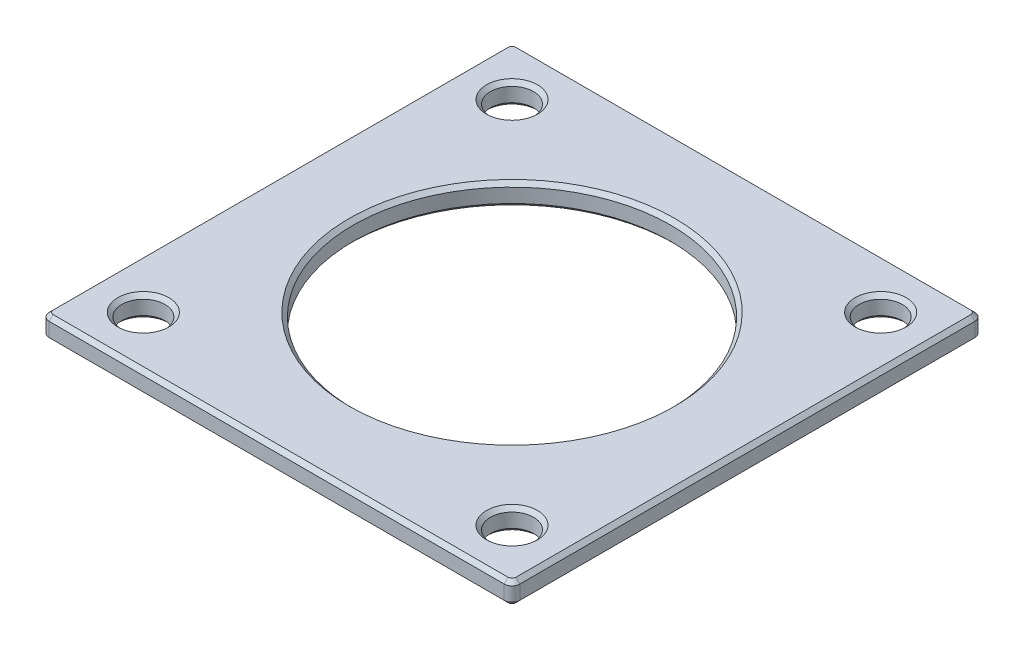
ISO-10303-21;
HEADER;
FILE_DESCRIPTION(('STEP AP214'),'2;1');
FILE_NAME('part.step','',(''),(''),'','','');
FILE_SCHEMA(('AUTOMOTIVE_DESIGN { 1 0 10303 214 1 1 1 1 }'));
ENDSEC;
DATA;
#1=APPLICATION_CONTEXT('core data for automotive mechanical design processes');
#2=APPLICATION_PROTOCOL_DEFINITION('international standard','automotive_design',2000,#1);
#3=PRODUCT_CONTEXT('',#1,'mechanical');
#4=PRODUCT('Part','Part','',(#3));
#5=PRODUCT_RELATED_PRODUCT_CATEGORY('part','',(#4));
#6=PRODUCT_DEFINITION_FORMATION('','',#4);
#7=PRODUCT_DEFINITION_CONTEXT('part definition',#1,'design');
#8=PRODUCT_DEFINITION('design','',#6,#7);
#9=PRODUCT_DEFINITION_SHAPE('','',#8);
#10=(LENGTH_UNIT() NAMED_UNIT(*) SI_UNIT(.MILLI.,.METRE.));
#11=(NAMED_UNIT(*) PLANE_ANGLE_UNIT() SI_UNIT($,.RADIAN.));
#12=(NAMED_UNIT(*) SI_UNIT($,.STERADIAN.) SOLID_ANGLE_UNIT());
#13=UNCERTAINTY_MEASURE_WITH_UNIT(LENGTH_MEASURE(1.E-05),#10,'distance_accuracy_value','');
#14=(GEOMETRIC_REPRESENTATION_CONTEXT(3) GLOBAL_UNCERTAINTY_ASSIGNED_CONTEXT((#13)) GLOBAL_UNIT_ASSIGNED_CONTEXT((#10,
#11,#12)) REPRESENTATION_CONTEXT('',''));
#15=CARTESIAN_POINT('',(0.,0.,0.));
#16=DIRECTION('',(0.,0.,1.));
#17=DIRECTION('',(1.,0.,0.));
#18=AXIS2_PLACEMENT_3D('',#15,#16,#17);
#19=CARTESIAN_POINT('',(-60.3975927313227,2.8,64.4871255064724));
#20=DIRECTION('',(0.,-1.,0.));
#21=DIRECTION('',(0.,0.,-1.));
#22=AXIS2_PLACEMENT_3D('',#19,#20,#21);
#23=PLANE('',#22);
#24=CARTESIAN_POINT('',(-54.8975927313226,2.8,58.9871255064727));
#25=DIRECTION('',(0.,-1.,0.));
#26=DIRECTION('',(0.,0.,-1.));
#27=AXIS2_PLACEMENT_3D('',#24,#25,#26);
#28=CIRCLE('',#27,3.24999999999999);
#29=CARTESIAN_POINT('',(-54.8975927313226,2.8,55.7371255064727));
#30=VERTEX_POINT('',#29);
#31=EDGE_CURVE('E11',#30,#30,#28,.T.);
#32=ORIENTED_EDGE('',*,*,#31,.T.);
#33=EDGE_LOOP('',(#32));
#34=FACE_BOUND('',#33,.T.);
#35=CARTESIAN_POINT('',(-7.89759273132259,2.8,58.9871255064725));
#36=DIRECTION('',(0.,-1.,0.));
#37=DIRECTION('',(0.,0.,-1.));
#38=AXIS2_PLACEMENT_3D('',#35,#36,#37);
#39=CIRCLE('',#38,3.24999999999999);
#40=CARTESIAN_POINT('',(-7.89759273132259,2.8,55.7371255064725));
#41=VERTEX_POINT('',#40);
#42=EDGE_CURVE('E51',#41,#41,#39,.T.);
#43=ORIENTED_EDGE('',*,*,#42,.T.);
#44=EDGE_LOOP('',(#43));
#45=FACE_BOUND('',#44,.T.);
#46=CARTESIAN_POINT('',(-7.89759273132278,2.8,11.9871255064722));
#47=DIRECTION('',(0.,-1.,0.));
#48=DIRECTION('',(0.,0.,-1.));
#49=AXIS2_PLACEMENT_3D('',#46,#47,#48);
#50=CIRCLE('',#49,3.24999999999999);
#51=CARTESIAN_POINT('',(-7.89759273132278,2.8,8.7371255064722));
#52=VERTEX_POINT('',#51);
#53=EDGE_CURVE('E281',#52,#52,#50,.T.);
#54=ORIENTED_EDGE('',*,*,#53,.T.);
#55=EDGE_LOOP('',(#54));
#56=FACE_BOUND('',#55,.T.);
#57=CARTESIAN_POINT('',(-54.8975927313228,2.8,11.9871255064724));
#58=DIRECTION('',(0.,-1.,0.));
#59=DIRECTION('',(0.,0.,-1.));
#60=AXIS2_PLACEMENT_3D('',#57,#58,#59);
#61=CIRCLE('',#60,3.24999999999999);
#62=CARTESIAN_POINT('',(-54.8975927313228,2.8,8.73712550647237));
#63=VERTEX_POINT('',#62);
#64=EDGE_CURVE('E278',#63,#63,#61,.T.);
#65=ORIENTED_EDGE('',*,*,#64,.T.);
#66=EDGE_LOOP('',(#65));
#67=FACE_BOUND('',#66,.T.);
#68=CARTESIAN_POINT('',(-31.3975927313227,2.8,35.4871255064724));
#69=DIRECTION('',(0.,-1.,0.));
#70=DIRECTION('',(0.,0.,-1.));
#71=AXIS2_PLACEMENT_3D('',#68,#69,#70);
#72=CIRCLE('',#71,20.75);
#73=CARTESIAN_POINT('',(-31.3975927313227,2.8,14.7371255064724));
#74=VERTEX_POINT('',#73);
#75=EDGE_CURVE('E275',#74,#74,#72,.T.);
#76=ORIENTED_EDGE('',*,*,#75,.T.);
#77=EDGE_LOOP('',(#76));
#78=FACE_BOUND('',#77,.T.);
#79=CARTESIAN_POINT('',(-60.3975927313227,2.8,6.48712550647243));
#80=DIRECTION('',(0.,-1.,0.));
#81=DIRECTION('',(0.,0.,-1.));
#82=AXIS2_PLACEMENT_3D('',#79,#80,#81);
#83=CIRCLE('',#82,0.499999999999994);
#84=CARTESIAN_POINT('',(-60.3975927313227,2.8,5.98712550647244));
#85=VERTEX_POINT('',#84);
#86=CARTESIAN_POINT('',(-60.8975927313227,2.8,6.48712550647244));
#87=VERTEX_POINT('',#86);
#88=EDGE_CURVE('E59',#85,#87,#83,.F.);
#89=ORIENTED_EDGE('',*,*,#88,.T.);
#90=DIRECTION('',(0.,0.,1.));
#91=VECTOR('',#90,1.);
#92=CARTESIAN_POINT('',(-60.8975927313227,2.8,64.4871255064724));
#93=LINE('',#92,#91);
#94=CARTESIAN_POINT('',(-60.8975927313227,2.8,64.4871255064724));
#95=VERTEX_POINT('',#94);
#96=EDGE_CURVE('E273',#87,#95,#93,.T.);
#97=ORIENTED_EDGE('',*,*,#96,.T.);
#98=CARTESIAN_POINT('',(-60.3975927313227,2.8,64.4871255064724));
#99=DIRECTION('',(0.,-1.,0.));
#100=DIRECTION('',(0.,0.,-1.));
#101=AXIS2_PLACEMENT_3D('',#98,#99,#100);
#102=CIRCLE('',#101,0.5);
#103=CARTESIAN_POINT('',(-60.3975927313227,2.8,64.9871255064724));
#104=VERTEX_POINT('',#103);
#105=EDGE_CURVE('E261',#95,#104,#102,.F.);
#106=ORIENTED_EDGE('',*,*,#105,.T.);
#107=DIRECTION('',(1.,0.,0.));
#108=VECTOR('',#107,1.);
#109=CARTESIAN_POINT('',(-60.3975927313227,2.8,64.9871255064724));
#110=LINE('',#109,#108);
#111=CARTESIAN_POINT('',(-2.3975927313227,2.8,64.9871255064724));
#112=VERTEX_POINT('',#111);
#113=EDGE_CURVE('E263',#104,#112,#110,.T.);
#114=ORIENTED_EDGE('',*,*,#113,.T.);
#115=CARTESIAN_POINT('',(-2.39759273132269,2.8,64.4871255064724));
#116=DIRECTION('',(0.,-1.,0.));
#117=DIRECTION('',(0.,0.,-1.));
#118=AXIS2_PLACEMENT_3D('',#115,#116,#117);
#119=CIRCLE('',#118,0.499999999999987);
#120=CARTESIAN_POINT('',(-1.89759273132271,2.8,64.4871255064724));
#121=VERTEX_POINT('',#120);
#122=EDGE_CURVE('E265',#112,#121,#119,.F.);
#123=ORIENTED_EDGE('',*,*,#122,.T.);
#124=DIRECTION('',(0.,0.,-1.));
#125=VECTOR('',#124,1.);
#126=CARTESIAN_POINT('',(-1.8975927313227,2.8,64.4871255064724));
#127=LINE('',#126,#125);
#128=CARTESIAN_POINT('',(-1.8975927313227,2.8,6.48712550647244));
#129=VERTEX_POINT('',#128);
#130=EDGE_CURVE('E267',#121,#129,#127,.T.);
#131=ORIENTED_EDGE('',*,*,#130,.T.);
#132=CARTESIAN_POINT('',(-2.39759273132269,2.8,6.48712550647243));
#133=DIRECTION('',(0.,-1.,0.));
#134=DIRECTION('',(0.,0.,-1.));
#135=AXIS2_PLACEMENT_3D('',#132,#133,#134);
#136=CIRCLE('',#135,0.499999999999992);
#137=CARTESIAN_POINT('',(-2.3975927313227,2.8,5.98712550647244));
#138=VERTEX_POINT('',#137);
#139=EDGE_CURVE('E269',#129,#138,#136,.F.);
#140=ORIENTED_EDGE('',*,*,#139,.T.);
#141=DIRECTION('',(-1.,0.,0.));
#142=VECTOR('',#141,1.);
#143=CARTESIAN_POINT('',(-60.3975927313227,2.8,5.98712550647244));
#144=LINE('',#143,#142);
#145=EDGE_CURVE('E64',#138,#85,#144,.T.);
#146=ORIENTED_EDGE('',*,*,#145,.T.);
#147=EDGE_LOOP('',(#89,#97,#106,#114,#123,#131,#140,#146));
#148=FACE_BOUND('',#147,.T.);
#149=ADVANCED_FACE('F41',(#34,#45,#56,#67,#78,#148),#23,.F.);
#150=CARTESIAN_POINT('',(-60.3975927313227,0.,64.4871255064724));
#151=DIRECTION('',(0.,-1.,0.));
#152=DIRECTION('',(0.,0.,-1.));
#153=AXIS2_PLACEMENT_3D('',#150,#151,#152);
#154=PLANE('',#153);
#155=CARTESIAN_POINT('',(-54.8975927313226,0.,58.9871255064727));
#156=DIRECTION('',(0.,-1.,0.));
#157=DIRECTION('',(0.,0.,-1.));
#158=AXIS2_PLACEMENT_3D('',#155,#156,#157);
#159=CIRCLE('',#158,3.25000000000002);
#160=CARTESIAN_POINT('',(-54.8975927313226,0.,55.7371255064727));
#161=VERTEX_POINT('',#160);
#162=EDGE_CURVE('E196',#161,#161,#159,.F.);
#163=ORIENTED_EDGE('',*,*,#162,.T.);
#164=EDGE_LOOP('',(#163));
#165=FACE_BOUND('',#164,.T.);
#166=CARTESIAN_POINT('',(-7.89759273132278,0.,11.9871255064722));
#167=DIRECTION('',(0.,-1.,0.));
#168=DIRECTION('',(0.,0.,-1.));
#169=AXIS2_PLACEMENT_3D('',#166,#167,#168);
#170=CIRCLE('',#169,3.24999999999999);
#171=CARTESIAN_POINT('',(-7.89759273132278,0.,8.7371255064722));
#172=VERTEX_POINT('',#171);
#173=EDGE_CURVE('E188',#172,#172,#170,.F.);
#174=ORIENTED_EDGE('',*,*,#173,.T.);
#175=EDGE_LOOP('',(#174));
#176=FACE_BOUND('',#175,.T.);
#177=CARTESIAN_POINT('',(-31.3975927313227,0.,35.4871255064724));
#178=DIRECTION('',(0.,-1.,0.));
#179=DIRECTION('',(0.,0.,-1.));
#180=AXIS2_PLACEMENT_3D('',#177,#178,#179);
#181=CIRCLE('',#180,20.75);
#182=CARTESIAN_POINT('',(-31.3975927313227,0.,14.7371255064724));
#183=VERTEX_POINT('',#182);
#184=EDGE_CURVE('E185',#183,#183,#181,.F.);
#185=ORIENTED_EDGE('',*,*,#184,.T.);
#186=EDGE_LOOP('',(#185));
#187=FACE_BOUND('',#186,.T.);
#188=CARTESIAN_POINT('',(-2.39759273132269,0.,64.4871255064724));
#189=DIRECTION('',(0.,-1.,0.));
#190=DIRECTION('',(0.,0.,-1.));
#191=AXIS2_PLACEMENT_3D('',#188,#189,#190);
#192=CIRCLE('',#191,0.5);
#193=CARTESIAN_POINT('',(-1.89759273132269,0.,64.4871255064724));
#194=VERTEX_POINT('',#193);
#195=CARTESIAN_POINT('',(-2.3975927313227,0.,64.9871255064724));
#196=VERTEX_POINT('',#195);
#197=EDGE_CURVE('E184',#194,#196,#192,.T.);
#198=ORIENTED_EDGE('',*,*,#197,.T.);
#199=DIRECTION('',(-1.,0.,0.));
#200=VECTOR('',#199,1.);
#201=CARTESIAN_POINT('',(-60.3975927313227,0.,64.9871255064724));
#202=LINE('',#201,#200);
#203=CARTESIAN_POINT('',(-60.3975927313227,0.,64.9871255064724));
#204=VERTEX_POINT('',#203);
#205=EDGE_CURVE('E162',#196,#204,#202,.T.);
#206=ORIENTED_EDGE('',*,*,#205,.T.);
#207=CARTESIAN_POINT('',(-60.3975927313227,0.,64.4871255064724));
#208=DIRECTION('',(0.,-1.,0.));
#209=DIRECTION('',(0.,0.,-1.));
#210=AXIS2_PLACEMENT_3D('',#207,#208,#209);
#211=CIRCLE('',#210,0.5);
#212=CARTESIAN_POINT('',(-60.8975927313227,0.,64.4871255064724));
#213=VERTEX_POINT('',#212);
#214=EDGE_CURVE('E172',#204,#213,#211,.T.);
#215=ORIENTED_EDGE('',*,*,#214,.T.);
#216=DIRECTION('',(0.,0.,-1.));
#217=VECTOR('',#216,1.);
#218=CARTESIAN_POINT('',(-60.8975927313227,0.,6.48712550647244));
#219=LINE('',#218,#217);
#220=CARTESIAN_POINT('',(-60.8975927313227,0.,6.48712550647244));
#221=VERTEX_POINT('',#220);
#222=EDGE_CURVE('E178',#213,#221,#219,.T.);
#223=ORIENTED_EDGE('',*,*,#222,.T.);
#224=CARTESIAN_POINT('',(-60.3975927313227,0.,6.48712550647243));
#225=DIRECTION('',(0.,-1.,0.));
#226=DIRECTION('',(0.,0.,-1.));
#227=AXIS2_PLACEMENT_3D('',#224,#225,#226);
#228=CIRCLE('',#227,0.5);
#229=CARTESIAN_POINT('',(-60.3975927313227,0.,5.98712550647243));
#230=VERTEX_POINT('',#229);
#231=EDGE_CURVE('E364',#221,#230,#228,.T.);
#232=ORIENTED_EDGE('',*,*,#231,.T.);
#233=DIRECTION('',(1.,0.,0.));
#234=VECTOR('',#233,1.);
#235=CARTESIAN_POINT('',(-2.3975927313227,0.,5.98712550647243));
#236=LINE('',#235,#234);
#237=CARTESIAN_POINT('',(-2.3975927313227,0.,5.98712550647243));
#238=VERTEX_POINT('',#237);
#239=EDGE_CURVE('E366',#230,#238,#236,.T.);
#240=ORIENTED_EDGE('',*,*,#239,.T.);
#241=CARTESIAN_POINT('',(-2.39759273132269,0.,6.48712550647243));
#242=DIRECTION('',(0.,-1.,0.));
#243=DIRECTION('',(0.,0.,-1.));
#244=AXIS2_PLACEMENT_3D('',#241,#242,#243);
#245=CIRCLE('',#244,0.500000000000001);
#246=CARTESIAN_POINT('',(-1.89759273132269,0.,6.48712550647244));
#247=VERTEX_POINT('',#246);
#248=EDGE_CURVE('E368',#238,#247,#245,.T.);
#249=ORIENTED_EDGE('',*,*,#248,.T.);
#250=DIRECTION('',(0.,0.,1.));
#251=VECTOR('',#250,1.);
#252=CARTESIAN_POINT('',(-1.89759273132269,0.,64.4871255064724));
#253=LINE('',#252,#251);
#254=EDGE_CURVE('E190',#247,#194,#253,.T.);
#255=ORIENTED_EDGE('',*,*,#254,.T.);
#256=EDGE_LOOP('',(#198,#206,#215,#223,#232,#240,#249,#255));
#257=FACE_BOUND('',#256,.T.);
#258=CARTESIAN_POINT('',(-54.8975927313228,0.,11.9871255064724));
#259=DIRECTION('',(0.,-1.,0.));
#260=DIRECTION('',(0.,0.,-1.));
#261=AXIS2_PLACEMENT_3D('',#258,#259,#260);
#262=CIRCLE('',#261,3.24999999999999);
#263=CARTESIAN_POINT('',(-54.8975927313228,0.,8.73712550647237));
#264=VERTEX_POINT('',#263);
#265=EDGE_CURVE('E179',#264,#264,#262,.F.);
#266=ORIENTED_EDGE('',*,*,#265,.T.);
#267=EDGE_LOOP('',(#266));
#268=FACE_BOUND('',#267,.T.);
#269=CARTESIAN_POINT('',(-7.89759273132259,0.,58.9871255064725));
#270=DIRECTION('',(0.,-1.,0.));
#271=DIRECTION('',(0.,0.,-1.));
#272=AXIS2_PLACEMENT_3D('',#269,#270,#271);
#273=CIRCLE('',#272,3.25);
#274=CARTESIAN_POINT('',(-7.89759273132259,0.,55.7371255064725));
#275=VERTEX_POINT('',#274);
#276=EDGE_CURVE('E358',#275,#275,#273,.F.);
#277=ORIENTED_EDGE('',*,*,#276,.T.);
#278=EDGE_LOOP('',(#277));
#279=FACE_BOUND('',#278,.T.);
#280=ADVANCED_FACE('F181',(#165,#176,#187,#257,#268,#279),#154,.T.);
#281=CARTESIAN_POINT('',(-60.3975927313227,2.8,64.4871255064724));
#282=DIRECTION('',(0.,-1.,0.));
#283=DIRECTION('',(0.,0.,-1.));
#284=AXIS2_PLACEMENT_3D('',#281,#282,#283);
#285=CYLINDRICAL_SURFACE('',#284,1.);
#286=DIRECTION('',(0.,-1.,0.));
#287=VECTOR('',#286,1.);
#288=CARTESIAN_POINT('',(-61.3975927313227,2.8,64.4871255064724));
#289=LINE('',#288,#287);
#290=CARTESIAN_POINT('',(-61.3975927313227,2.3,64.4871255064724));
#291=VERTEX_POINT('',#290);
#292=CARTESIAN_POINT('',(-61.3975927313227,0.49999999999999,64.4871255064724));
#293=VERTEX_POINT('',#292);
#294=EDGE_CURVE('E302',#291,#293,#289,.T.);
#295=ORIENTED_EDGE('',*,*,#294,.T.);
#296=CARTESIAN_POINT('',(-60.3975927313227,0.49999999999999,64.4871255064724));
#297=DIRECTION('',(0.,-1.,0.));
#298=DIRECTION('',(0.,0.,-1.));
#299=AXIS2_PLACEMENT_3D('',#296,#297,#298);
#300=CIRCLE('',#299,1.);
#301=CARTESIAN_POINT('',(-60.3975927313227,0.49999999999999,65.4871255064724));
#302=VERTEX_POINT('',#301);
#303=EDGE_CURVE('E247',#293,#302,#300,.F.);
#304=ORIENTED_EDGE('',*,*,#303,.T.);
#305=DIRECTION('',(0.,-1.,0.));
#306=VECTOR('',#305,1.);
#307=CARTESIAN_POINT('',(-60.3975927313227,2.8,65.4871255064724));
#308=LINE('',#307,#306);
#309=CARTESIAN_POINT('',(-60.3975927313227,2.3,65.4871255064724));
#310=VERTEX_POINT('',#309);
#311=EDGE_CURVE('E350',#310,#302,#308,.T.);
#312=ORIENTED_EDGE('',*,*,#311,.F.);
#313=CARTESIAN_POINT('',(-60.3975927313227,2.3,64.4871255064724));
#314=DIRECTION('',(0.,-1.,0.));
#315=DIRECTION('',(0.,0.,-1.));
#316=AXIS2_PLACEMENT_3D('',#313,#314,#315);
#317=CIRCLE('',#316,1.);
#318=EDGE_CURVE('E245',#310,#291,#317,.T.);
#319=ORIENTED_EDGE('',*,*,#318,.T.);
#320=EDGE_LOOP('',(#295,#304,#312,#319));
#321=FACE_BOUND('',#320,.T.);
#322=ADVANCED_FACE('F385',(#321),#285,.T.);
#323=CARTESIAN_POINT('',(-2.3975927313227,2.8,65.4871255064724));
#324=DIRECTION('',(0.,0.,-1.));
#325=DIRECTION('',(-1.,0.,0.));
#326=AXIS2_PLACEMENT_3D('',#323,#324,#325);
#327=PLANE('',#326);
#328=ORIENTED_EDGE('',*,*,#311,.T.);
#329=DIRECTION('',(1.,0.,0.));
#330=VECTOR('',#329,1.);
#331=CARTESIAN_POINT('',(-2.3975927313227,0.49999999999999,65.4871255064724));
#332=LINE('',#331,#330);
#333=CARTESIAN_POINT('',(-2.3975927313227,0.49999999999999,65.4871255064724));
#334=VERTEX_POINT('',#333);
#335=EDGE_CURVE('E165',#302,#334,#332,.T.);
#336=ORIENTED_EDGE('',*,*,#335,.T.);
#337=DIRECTION('',(0.,-1.,0.));
#338=VECTOR('',#337,1.);
#339=CARTESIAN_POINT('',(-2.3975927313227,2.8,65.4871255064724));
#340=LINE('',#339,#338);
#341=CARTESIAN_POINT('',(-2.3975927313227,2.3,65.4871255064724));
#342=VERTEX_POINT('',#341);
#343=EDGE_CURVE('E348',#342,#334,#340,.T.);
#344=ORIENTED_EDGE('',*,*,#343,.F.);
#345=DIRECTION('',(-1.,0.,0.));
#346=VECTOR('',#345,1.);
#347=CARTESIAN_POINT('',(-2.3975927313227,2.3,65.4871255064724));
#348=LINE('',#347,#346);
#349=EDGE_CURVE('E217',#342,#310,#348,.T.);
#350=ORIENTED_EDGE('',*,*,#349,.T.);
#351=EDGE_LOOP('',(#328,#336,#344,#350));
#352=FACE_BOUND('',#351,.T.);
#353=ADVANCED_FACE('F378',(#352),#327,.F.);
#354=CARTESIAN_POINT('',(-2.39759273132269,2.8,64.4871255064724));
#355=DIRECTION('',(0.,-1.,0.));
#356=DIRECTION('',(0.,0.,-1.));
#357=AXIS2_PLACEMENT_3D('',#354,#355,#356);
#358=CYLINDRICAL_SURFACE('',#357,1.);
#359=ORIENTED_EDGE('',*,*,#343,.T.);
#360=CARTESIAN_POINT('',(-2.39759273132269,0.49999999999999,64.4871255064724));
#361=DIRECTION('',(0.,-1.,0.));
#362=DIRECTION('',(0.,0.,-1.));
#363=AXIS2_PLACEMENT_3D('',#360,#361,#362);
#364=CIRCLE('',#363,1.);
#365=CARTESIAN_POINT('',(-1.39759273132269,0.49999999999999,64.4871255064724));
#366=VERTEX_POINT('',#365);
#367=EDGE_CURVE('E222',#334,#366,#364,.F.);
#368=ORIENTED_EDGE('',*,*,#367,.T.);
#369=DIRECTION('',(0.,-1.,0.));
#370=VECTOR('',#369,1.);
#371=CARTESIAN_POINT('',(-1.39759273132269,2.8,64.4871255064724));
#372=LINE('',#371,#370);
#373=CARTESIAN_POINT('',(-1.39759273132269,2.3,64.4871255064724));
#374=VERTEX_POINT('',#373);
#375=EDGE_CURVE('E339',#374,#366,#372,.T.);
#376=ORIENTED_EDGE('',*,*,#375,.F.);
#377=CARTESIAN_POINT('',(-2.39759273132269,2.3,64.4871255064724));
#378=DIRECTION('',(0.,-1.,0.));
#379=DIRECTION('',(0.,0.,-1.));
#380=AXIS2_PLACEMENT_3D('',#377,#378,#379);
#381=CIRCLE('',#380,1.);
#382=EDGE_CURVE('E220',#374,#342,#381,.T.);
#383=ORIENTED_EDGE('',*,*,#382,.T.);
#384=EDGE_LOOP('',(#359,#368,#376,#383));
#385=FACE_BOUND('',#384,.T.);
#386=ADVANCED_FACE('F345',(#385),#358,.T.);
#387=CARTESIAN_POINT('',(-1.39759273132269,2.8,64.4871255064724));
#388=DIRECTION('',(-1.,0.,0.));
#389=DIRECTION('',(0.,0.,1.));
#390=AXIS2_PLACEMENT_3D('',#387,#388,#389);
#391=PLANE('',#390);
#392=ORIENTED_EDGE('',*,*,#375,.T.);
#393=DIRECTION('',(0.,0.,-1.));
#394=VECTOR('',#393,1.);
#395=CARTESIAN_POINT('',(-1.39759273132269,0.49999999999999,6.48712550647244));
#396=LINE('',#395,#394);
#397=CARTESIAN_POINT('',(-1.39759273132269,0.49999999999999,6.48712550647244));
#398=VERTEX_POINT('',#397);
#399=EDGE_CURVE('E226',#366,#398,#396,.T.);
#400=ORIENTED_EDGE('',*,*,#399,.T.);
#401=DIRECTION('',(0.,-1.,0.));
#402=VECTOR('',#401,1.);
#403=CARTESIAN_POINT('',(-1.39759273132269,2.8,6.48712550647244));
#404=LINE('',#403,#402);
#405=CARTESIAN_POINT('',(-1.39759273132269,2.3,6.48712550647244));
#406=VERTEX_POINT('',#405);
#407=EDGE_CURVE('E342',#406,#398,#404,.T.);
#408=ORIENTED_EDGE('',*,*,#407,.F.);
#409=DIRECTION('',(0.,0.,1.));
#410=VECTOR('',#409,1.);
#411=CARTESIAN_POINT('',(-1.39759273132269,2.3,64.4871255064724));
#412=LINE('',#411,#410);
#413=EDGE_CURVE('E224',#406,#374,#412,.T.);
#414=ORIENTED_EDGE('',*,*,#413,.T.);
#415=EDGE_LOOP('',(#392,#400,#408,#414));
#416=FACE_BOUND('',#415,.T.);
#417=ADVANCED_FACE('F338',(#416),#391,.F.);
#418=CARTESIAN_POINT('',(-2.39759273132269,2.8,6.48712550647243));
#419=DIRECTION('',(0.,-1.,0.));
#420=DIRECTION('',(0.,0.,-1.));
#421=AXIS2_PLACEMENT_3D('',#418,#419,#420);
#422=CYLINDRICAL_SURFACE('',#421,1.);
#423=ORIENTED_EDGE('',*,*,#407,.T.);
#424=CARTESIAN_POINT('',(-2.39759273132269,0.49999999999999,6.48712550647243));
#425=DIRECTION('',(0.,-1.,0.));
#426=DIRECTION('',(0.,0.,-1.));
#427=AXIS2_PLACEMENT_3D('',#424,#425,#426);
#428=CIRCLE('',#427,1.);
#429=CARTESIAN_POINT('',(-2.3975927313227,0.49999999999999,5.48712550647243));
#430=VERTEX_POINT('',#429);
#431=EDGE_CURVE('E230',#398,#430,#428,.F.);
#432=ORIENTED_EDGE('',*,*,#431,.T.);
#433=DIRECTION('',(0.,-1.,0.));
#434=VECTOR('',#433,1.);
#435=CARTESIAN_POINT('',(-2.3975927313227,2.8,5.48712550647243));
#436=LINE('',#435,#434);
#437=CARTESIAN_POINT('',(-2.3975927313227,2.3,5.48712550647243));
#438=VERTEX_POINT('',#437);
#439=EDGE_CURVE('E352',#438,#430,#436,.T.);
#440=ORIENTED_EDGE('',*,*,#439,.F.);
#441=CARTESIAN_POINT('',(-2.39759273132269,2.3,6.48712550647243));
#442=DIRECTION('',(0.,-1.,0.));
#443=DIRECTION('',(0.,0.,-1.));
#444=AXIS2_PLACEMENT_3D('',#441,#442,#443);
#445=CIRCLE('',#444,1.);
#446=EDGE_CURVE('E228',#438,#406,#445,.T.);
#447=ORIENTED_EDGE('',*,*,#446,.T.);
#448=EDGE_LOOP('',(#423,#432,#440,#447));
#449=FACE_BOUND('',#448,.T.);
#450=ADVANCED_FACE('F430',(#449),#422,.T.);
#451=CARTESIAN_POINT('',(-2.3975927313227,2.8,5.48712550647243));
#452=DIRECTION('',(0.,0.,1.));
#453=DIRECTION('',(1.,0.,0.));
#454=AXIS2_PLACEMENT_3D('',#451,#452,#453);
#455=PLANE('',#454);
#456=ORIENTED_EDGE('',*,*,#439,.T.);
#457=DIRECTION('',(-1.,0.,0.));
#458=VECTOR('',#457,1.);
#459=CARTESIAN_POINT('',(-60.3975927313227,0.49999999999999,5.48712550647243));
#460=LINE('',#459,#458);
#461=CARTESIAN_POINT('',(-60.3975927313227,0.49999999999999,5.48712550647243));
#462=VERTEX_POINT('',#461);
#463=EDGE_CURVE('E234',#430,#462,#460,.T.);
#464=ORIENTED_EDGE('',*,*,#463,.T.);
#465=DIRECTION('',(0.,-1.,0.));
#466=VECTOR('',#465,1.);
#467=CARTESIAN_POINT('',(-60.3975927313227,2.8,5.48712550647243));
#468=LINE('',#467,#466);
#469=CARTESIAN_POINT('',(-60.3975927313227,2.3,5.48712550647243));
#470=VERTEX_POINT('',#469);
#471=EDGE_CURVE('E411',#470,#462,#468,.T.);
#472=ORIENTED_EDGE('',*,*,#471,.F.);
#473=DIRECTION('',(1.,0.,0.));
#474=VECTOR('',#473,1.);
#475=CARTESIAN_POINT('',(-2.3975927313227,2.3,5.48712550647243));
#476=LINE('',#475,#474);
#477=EDGE_CURVE('E232',#470,#438,#476,.T.);
#478=ORIENTED_EDGE('',*,*,#477,.T.);
#479=EDGE_LOOP('',(#456,#464,#472,#478));
#480=FACE_BOUND('',#479,.T.);
#481=ADVANCED_FACE('F419',(#480),#455,.F.);
#482=CARTESIAN_POINT('',(-60.3975927313227,2.8,6.48712550647243));
#483=DIRECTION('',(0.,-1.,0.));
#484=DIRECTION('',(0.,0.,-1.));
#485=AXIS2_PLACEMENT_3D('',#482,#483,#484);
#486=CYLINDRICAL_SURFACE('',#485,1.);
#487=ORIENTED_EDGE('',*,*,#471,.T.);
#488=CARTESIAN_POINT('',(-60.3975927313227,0.49999999999999,6.48712550647243));
#489=DIRECTION('',(0.,-1.,0.));
#490=DIRECTION('',(0.,0.,-1.));
#491=AXIS2_PLACEMENT_3D('',#488,#489,#490);
#492=CIRCLE('',#491,1.);
#493=CARTESIAN_POINT('',(-61.3975927313227,0.49999999999999,6.48712550647244));
#494=VERTEX_POINT('',#493);
#495=EDGE_CURVE('E238',#462,#494,#492,.F.);
#496=ORIENTED_EDGE('',*,*,#495,.T.);
#497=DIRECTION('',(0.,-1.,0.));
#498=VECTOR('',#497,1.);
#499=CARTESIAN_POINT('',(-61.3975927313227,2.8,6.48712550647244));
#500=LINE('',#499,#498);
#501=CARTESIAN_POINT('',(-61.3975927313227,2.3,6.48712550647244));
#502=VERTEX_POINT('',#501);
#503=EDGE_CURVE('E404',#502,#494,#500,.T.);
#504=ORIENTED_EDGE('',*,*,#503,.F.);
#505=CARTESIAN_POINT('',(-60.3975927313227,2.3,6.48712550647243));
#506=DIRECTION('',(0.,-1.,0.));
#507=DIRECTION('',(0.,0.,-1.));
#508=AXIS2_PLACEMENT_3D('',#505,#506,#507);
#509=CIRCLE('',#508,1.);
#510=EDGE_CURVE('E236',#502,#470,#509,.T.);
#511=ORIENTED_EDGE('',*,*,#510,.T.);
#512=EDGE_LOOP('',(#487,#496,#504,#511));
#513=FACE_BOUND('',#512,.T.);
#514=ADVANCED_FACE('F408',(#513),#486,.T.);
#515=CARTESIAN_POINT('',(-61.3975927313227,2.8,64.4871255064724));
#516=DIRECTION('',(1.,0.,0.));
#517=DIRECTION('',(0.,0.,-1.));
#518=AXIS2_PLACEMENT_3D('',#515,#516,#517);
#519=PLANE('',#518);
#520=ORIENTED_EDGE('',*,*,#503,.T.);
#521=DIRECTION('',(0.,0.,1.));
#522=VECTOR('',#521,1.);
#523=CARTESIAN_POINT('',(-61.3975927313227,0.49999999999999,64.4871255064724));
#524=LINE('',#523,#522);
#525=EDGE_CURVE('E243',#494,#293,#524,.T.);
#526=ORIENTED_EDGE('',*,*,#525,.T.);
#527=ORIENTED_EDGE('',*,*,#294,.F.);
#528=DIRECTION('',(0.,0.,-1.));
#529=VECTOR('',#528,1.);
#530=CARTESIAN_POINT('',(-61.3975927313227,2.3,64.4871255064724));
#531=LINE('',#530,#529);
#532=EDGE_CURVE('E240',#291,#502,#531,.T.);
#533=ORIENTED_EDGE('',*,*,#532,.T.);
#534=EDGE_LOOP('',(#520,#526,#527,#533));
#535=FACE_BOUND('',#534,.T.);
#536=ADVANCED_FACE('F403',(#535),#519,.F.);
#537=CARTESIAN_POINT('',(-31.3975927313227,2.8,35.4871255064724));
#538=DIRECTION('',(0.,-1.,0.));
#539=DIRECTION('',(0.,0.,-1.));
#540=AXIS2_PLACEMENT_3D('',#537,#538,#539);
#541=CYLINDRICAL_SURFACE('',#540,20.25);
#542=CARTESIAN_POINT('',(-31.3975927313227,0.499999999999994,35.4871255064724));
#543=DIRECTION('',(0.,-1.,0.));
#544=DIRECTION('',(0.,0.,-1.));
#545=AXIS2_PLACEMENT_3D('',#542,#543,#544);
#546=CIRCLE('',#545,20.25);
#547=CARTESIAN_POINT('',(-31.3975927313227,0.499999999999994,15.2371255064724));
#548=VERTEX_POINT('',#547);
#549=EDGE_CURVE('E214',#548,#548,#546,.T.);
#550=ORIENTED_EDGE('',*,*,#549,.T.);
#551=EDGE_LOOP('',(#550));
#552=FACE_BOUND('',#551,.T.);
#553=CARTESIAN_POINT('',(-31.3975927313227,2.3,35.4871255064724));
#554=DIRECTION('',(0.,-1.,0.));
#555=DIRECTION('',(0.,0.,-1.));
#556=AXIS2_PLACEMENT_3D('',#553,#554,#555);
#557=CIRCLE('',#556,20.25);
#558=CARTESIAN_POINT('',(-31.3975927313227,2.3,15.2371255064724));
#559=VERTEX_POINT('',#558);
#560=EDGE_CURVE('E211',#559,#559,#557,.F.);
#561=ORIENTED_EDGE('',*,*,#560,.T.);
#562=EDGE_LOOP('',(#561));
#563=FACE_BOUND('',#562,.T.);
#564=ADVANCED_FACE('F449',(#552,#563),#541,.F.);
#565=CARTESIAN_POINT('',(-54.8975927313228,2.8,11.9871255064724));
#566=DIRECTION('',(0.,-1.,0.));
#567=DIRECTION('',(0.,0.,-1.));
#568=AXIS2_PLACEMENT_3D('',#565,#566,#567);
#569=CYLINDRICAL_SURFACE('',#568,2.75);
#570=CARTESIAN_POINT('',(-54.8975927313228,0.499999999999992,11.9871255064724));
#571=DIRECTION('',(0.,-1.,0.));
#572=DIRECTION('',(0.,0.,-1.));
#573=AXIS2_PLACEMENT_3D('',#570,#571,#572);
#574=CIRCLE('',#573,2.75);
#575=CARTESIAN_POINT('',(-54.8975927313228,0.499999999999992,9.23712550647235));
#576=VERTEX_POINT('',#575);
#577=EDGE_CURVE('E252',#576,#576,#574,.T.);
#578=ORIENTED_EDGE('',*,*,#577,.T.);
#579=EDGE_LOOP('',(#578));
#580=FACE_BOUND('',#579,.T.);
#581=CARTESIAN_POINT('',(-54.8975927313228,2.3,11.9871255064724));
#582=DIRECTION('',(0.,-1.,0.));
#583=DIRECTION('',(0.,0.,-1.));
#584=AXIS2_PLACEMENT_3D('',#581,#582,#583);
#585=CIRCLE('',#584,2.75);
#586=CARTESIAN_POINT('',(-54.8975927313228,2.3,9.23712550647235));
#587=VERTEX_POINT('',#586);
#588=EDGE_CURVE('E249',#587,#587,#585,.F.);
#589=ORIENTED_EDGE('',*,*,#588,.T.);
#590=EDGE_LOOP('',(#589));
#591=FACE_BOUND('',#590,.T.);
#592=ADVANCED_FACE('F471',(#580,#591),#569,.F.);
#593=CARTESIAN_POINT('',(-7.89759273132278,2.8,11.9871255064722));
#594=DIRECTION('',(0.,-1.,0.));
#595=DIRECTION('',(0.,0.,-1.));
#596=AXIS2_PLACEMENT_3D('',#593,#594,#595);
#597=CYLINDRICAL_SURFACE('',#596,2.75);
#598=CARTESIAN_POINT('',(-7.89759273132278,0.499999999999994,11.9871255064722));
#599=DIRECTION('',(0.,-1.,0.));
#600=DIRECTION('',(0.,0.,-1.));
#601=AXIS2_PLACEMENT_3D('',#598,#599,#600);
#602=CIRCLE('',#601,2.75);
#603=CARTESIAN_POINT('',(-7.89759273132278,0.499999999999994,9.23712550647219));
#604=VERTEX_POINT('',#603);
#605=EDGE_CURVE('E208',#604,#604,#602,.T.);
#606=ORIENTED_EDGE('',*,*,#605,.T.);
#607=EDGE_LOOP('',(#606));
#608=FACE_BOUND('',#607,.T.);
#609=CARTESIAN_POINT('',(-7.89759273132278,2.3,11.9871255064722));
#610=DIRECTION('',(0.,-1.,0.));
#611=DIRECTION('',(0.,0.,-1.));
#612=AXIS2_PLACEMENT_3D('',#609,#610,#611);
#613=CIRCLE('',#612,2.75);
#614=CARTESIAN_POINT('',(-7.89759273132278,2.3,9.23712550647219));
#615=VERTEX_POINT('',#614);
#616=EDGE_CURVE('E205',#615,#615,#613,.F.);
#617=ORIENTED_EDGE('',*,*,#616,.T.);
#618=EDGE_LOOP('',(#617));
#619=FACE_BOUND('',#618,.T.);
#620=ADVANCED_FACE('F479',(#608,#619),#597,.F.);
#621=CARTESIAN_POINT('',(-7.89759273132259,2.8,58.9871255064725));
#622=DIRECTION('',(0.,-1.,0.));
#623=DIRECTION('',(0.,0.,-1.));
#624=AXIS2_PLACEMENT_3D('',#621,#622,#623);
#625=CYLINDRICAL_SURFACE('',#624,2.75);
#626=CARTESIAN_POINT('',(-7.89759273132259,0.500000000000005,58.9871255064725));
#627=DIRECTION('',(0.,-1.,0.));
#628=DIRECTION('',(0.,0.,-1.));
#629=AXIS2_PLACEMENT_3D('',#626,#627,#628);
#630=CIRCLE('',#629,2.75);
#631=CARTESIAN_POINT('',(-7.89759273132259,0.500000000000005,56.2371255064725));
#632=VERTEX_POINT('',#631);
#633=EDGE_CURVE('E258',#632,#632,#630,.T.);
#634=ORIENTED_EDGE('',*,*,#633,.T.);
#635=EDGE_LOOP('',(#634));
#636=FACE_BOUND('',#635,.T.);
#637=CARTESIAN_POINT('',(-7.89759273132259,2.3,58.9871255064725));
#638=DIRECTION('',(0.,-1.,0.));
#639=DIRECTION('',(0.,0.,-1.));
#640=AXIS2_PLACEMENT_3D('',#637,#638,#639);
#641=CIRCLE('',#640,2.75);
#642=CARTESIAN_POINT('',(-7.89759273132259,2.3,56.2371255064725));
#643=VERTEX_POINT('',#642);
#644=EDGE_CURVE('E255',#643,#643,#641,.F.);
#645=ORIENTED_EDGE('',*,*,#644,.T.);
#646=EDGE_LOOP('',(#645));
#647=FACE_BOUND('',#646,.T.);
#648=ADVANCED_FACE('F487',(#636,#647),#625,.F.);
#649=CARTESIAN_POINT('',(-54.8975927313226,2.8,58.9871255064727));
#650=DIRECTION('',(0.,-1.,0.));
#651=DIRECTION('',(0.,0.,-1.));
#652=AXIS2_PLACEMENT_3D('',#649,#650,#651);
#653=CYLINDRICAL_SURFACE('',#652,2.75);
#654=CARTESIAN_POINT('',(-54.8975927313226,0.500000000000024,58.9871255064727));
#655=DIRECTION('',(0.,-1.,0.));
#656=DIRECTION('',(0.,0.,-1.));
#657=AXIS2_PLACEMENT_3D('',#654,#655,#656);
#658=CIRCLE('',#657,2.75);
#659=CARTESIAN_POINT('',(-54.8975927313226,0.500000000000024,56.2371255064727));
#660=VERTEX_POINT('',#659);
#661=EDGE_CURVE('E202',#660,#660,#658,.T.);
#662=ORIENTED_EDGE('',*,*,#661,.T.);
#663=EDGE_LOOP('',(#662));
#664=FACE_BOUND('',#663,.T.);
#665=CARTESIAN_POINT('',(-54.8975927313226,2.3,58.9871255064727));
#666=DIRECTION('',(0.,-1.,0.));
#667=DIRECTION('',(0.,0.,-1.));
#668=AXIS2_PLACEMENT_3D('',#665,#666,#667);
#669=CIRCLE('',#668,2.75);
#670=CARTESIAN_POINT('',(-54.8975927313226,2.3,56.2371255064727));
#671=VERTEX_POINT('',#670);
#672=EDGE_CURVE('E199',#671,#671,#669,.F.);
#673=ORIENTED_EDGE('',*,*,#672,.T.);
#674=EDGE_LOOP('',(#673));
#675=FACE_BOUND('',#674,.T.);
#676=ADVANCED_FACE('F496',(#664,#675),#653,.F.);
#677=CARTESIAN_POINT('',(-54.8975927313226,0.,58.9871255064727));
#678=DIRECTION('',(0.,-1.,0.));
#679=DIRECTION('',(0.,0.,-1.));
#680=AXIS2_PLACEMENT_3D('',#677,#678,#679);
#681=CONICAL_SURFACE('',#680,3.25000000000002,0.785398163397446);
#682=ORIENTED_EDGE('',*,*,#661,.F.);
#683=EDGE_LOOP('',(#682));
#684=FACE_BOUND('',#683,.T.);
#685=ORIENTED_EDGE('',*,*,#162,.F.);
#686=EDGE_LOOP('',(#685));
#687=FACE_BOUND('',#686,.T.);
#688=ADVANCED_FACE('F505',(#684,#687),#681,.F.);
#689=CARTESIAN_POINT('',(-7.89759273132278,0.,11.9871255064722));
#690=DIRECTION('',(0.,-1.,0.));
#691=DIRECTION('',(0.,0.,-1.));
#692=AXIS2_PLACEMENT_3D('',#689,#690,#691);
#693=CONICAL_SURFACE('',#692,3.24999999999999,0.785398163397444);
#694=ORIENTED_EDGE('',*,*,#605,.F.);
#695=EDGE_LOOP('',(#694));
#696=FACE_BOUND('',#695,.T.);
#697=ORIENTED_EDGE('',*,*,#173,.F.);
#698=EDGE_LOOP('',(#697));
#699=FACE_BOUND('',#698,.T.);
#700=ADVANCED_FACE('F514',(#696,#699),#693,.F.);
#701=CARTESIAN_POINT('',(-31.3975927313227,0.,35.4871255064724));
#702=DIRECTION('',(0.,-1.,0.));
#703=DIRECTION('',(0.,0.,-1.));
#704=AXIS2_PLACEMENT_3D('',#701,#702,#703);
#705=CONICAL_SURFACE('',#704,20.75,0.785398163397441);
#706=ORIENTED_EDGE('',*,*,#549,.F.);
#707=EDGE_LOOP('',(#706));
#708=FACE_BOUND('',#707,.T.);
#709=ORIENTED_EDGE('',*,*,#184,.F.);
#710=EDGE_LOOP('',(#709));
#711=FACE_BOUND('',#710,.T.);
#712=ADVANCED_FACE('F523',(#708,#711),#705,.F.);
#713=CARTESIAN_POINT('',(-2.3975927313227,0.49999999999999,5.48712550647243));
#714=DIRECTION('',(0.,-0.707106781186552,-0.707106781186543));
#715=DIRECTION('',(1.,0.,0.));
#716=AXIS2_PLACEMENT_3D('',#713,#714,#715);
#717=PLANE('',#716);
#718=DIRECTION('',(0.,0.707106781186543,-0.707106781186552));
#719=VECTOR('',#718,1.);
#720=CARTESIAN_POINT('',(-2.3975927313227,0.,5.98712550647243));
#721=LINE('',#720,#719);
#722=EDGE_CURVE('E296',#238,#430,#721,.T.);
#723=ORIENTED_EDGE('',*,*,#722,.F.);
#724=ORIENTED_EDGE('',*,*,#239,.F.);
#725=DIRECTION('',(0.,-0.707106781186543,0.707106781186552));
#726=VECTOR('',#725,1.);
#727=CARTESIAN_POINT('',(-60.3975927313227,0.49999999999999,5.48712550647243));
#728=LINE('',#727,#726);
#729=EDGE_CURVE('E299',#462,#230,#728,.T.);
#730=ORIENTED_EDGE('',*,*,#729,.F.);
#731=ORIENTED_EDGE('',*,*,#463,.F.);
#732=EDGE_LOOP('',(#723,#724,#730,#731));
#733=FACE_BOUND('',#732,.T.);
#734=ADVANCED_FACE('F425',(#733),#717,.T.);
#735=CARTESIAN_POINT('',(-60.3975927313227,0.49999999999999,6.48712550647243));
#736=DIRECTION('',(0.,1.,0.));
#737=DIRECTION('',(0.,0.,1.));
#738=AXIS2_PLACEMENT_3D('',#735,#736,#737);
#739=CONICAL_SURFACE('',#738,1.,0.785398163397458);
#740=ORIENTED_EDGE('',*,*,#729,.T.);
#741=ORIENTED_EDGE('',*,*,#231,.F.);
#742=DIRECTION('',(0.707106781186555,-0.70710678118654,0.));
#743=VECTOR('',#742,1.);
#744=CARTESIAN_POINT('',(-61.3975927313227,0.49999999999999,6.48712550647244));
#745=LINE('',#744,#743);
#746=EDGE_CURVE('E293',#494,#221,#745,.T.);
#747=ORIENTED_EDGE('',*,*,#746,.F.);
#748=ORIENTED_EDGE('',*,*,#495,.F.);
#749=EDGE_LOOP('',(#740,#741,#747,#748));
#750=FACE_BOUND('',#749,.T.);
#751=ADVANCED_FACE('F540',(#750),#739,.T.);
#752=CARTESIAN_POINT('',(-2.39759273132269,0.49999999999999,6.48712550647243));
#753=DIRECTION('',(0.,1.,0.));
#754=DIRECTION('',(0.,0.,1.));
#755=AXIS2_PLACEMENT_3D('',#752,#753,#754);
#756=CONICAL_SURFACE('',#755,1.,0.785398163397457);
#757=ORIENTED_EDGE('',*,*,#722,.T.);
#758=ORIENTED_EDGE('',*,*,#431,.F.);
#759=DIRECTION('',(0.707106781186554,0.707106781186541,0.));
#760=VECTOR('',#759,1.);
#761=CARTESIAN_POINT('',(-1.89759273132269,0.,6.48712550647244));
#762=LINE('',#761,#760);
#763=EDGE_CURVE('E290',#247,#398,#762,.T.);
#764=ORIENTED_EDGE('',*,*,#763,.F.);
#765=ORIENTED_EDGE('',*,*,#248,.F.);
#766=EDGE_LOOP('',(#757,#758,#764,#765));
#767=FACE_BOUND('',#766,.T.);
#768=ADVANCED_FACE('F429',(#767),#756,.T.);
#769=CARTESIAN_POINT('',(-61.3975927313227,0.49999999999999,64.4871255064724));
#770=DIRECTION('',(-0.70710678118654,-0.707106781186555,0.));
#771=DIRECTION('',(0.,0.,-1.));
#772=AXIS2_PLACEMENT_3D('',#769,#770,#771);
#773=PLANE('',#772);
#774=ORIENTED_EDGE('',*,*,#746,.T.);
#775=ORIENTED_EDGE('',*,*,#222,.F.);
#776=DIRECTION('',(0.707106781186555,-0.70710678118654,0.));
#777=VECTOR('',#776,1.);
#778=CARTESIAN_POINT('',(-61.3975927313227,0.49999999999999,64.4871255064724));
#779=LINE('',#778,#777);
#780=EDGE_CURVE('E175',#293,#213,#779,.T.);
#781=ORIENTED_EDGE('',*,*,#780,.F.);
#782=ORIENTED_EDGE('',*,*,#525,.F.);
#783=EDGE_LOOP('',(#774,#775,#781,#782));
#784=FACE_BOUND('',#783,.T.);
#785=ADVANCED_FACE('F556',(#784),#773,.T.);
#786=CARTESIAN_POINT('',(-1.39759273132269,0.49999999999999,64.4871255064724));
#787=DIRECTION('',(0.707106781186541,-0.707106781186554,0.));
#788=DIRECTION('',(0.,0.,1.));
#789=AXIS2_PLACEMENT_3D('',#786,#787,#788);
#790=PLANE('',#789);
#791=ORIENTED_EDGE('',*,*,#763,.T.);
#792=ORIENTED_EDGE('',*,*,#399,.F.);
#793=DIRECTION('',(0.707106781186554,0.707106781186541,0.));
#794=VECTOR('',#793,1.);
#795=CARTESIAN_POINT('',(-1.89759273132269,0.,64.4871255064724));
#796=LINE('',#795,#794);
#797=EDGE_CURVE('E168',#194,#366,#796,.T.);
#798=ORIENTED_EDGE('',*,*,#797,.F.);
#799=ORIENTED_EDGE('',*,*,#254,.F.);
#800=EDGE_LOOP('',(#791,#792,#798,#799));
#801=FACE_BOUND('',#800,.T.);
#802=ADVANCED_FACE('F374',(#801),#790,.T.);
#803=CARTESIAN_POINT('',(-60.3975927313227,0.49999999999999,64.4871255064724));
#804=DIRECTION('',(0.,1.,0.));
#805=DIRECTION('',(0.,0.,1.));
#806=AXIS2_PLACEMENT_3D('',#803,#804,#805);
#807=CONICAL_SURFACE('',#806,1.,0.785398163397459);
#808=ORIENTED_EDGE('',*,*,#780,.T.);
#809=ORIENTED_EDGE('',*,*,#214,.F.);
#810=DIRECTION('',(0.,-0.70710678118654,-0.707106781186555));
#811=VECTOR('',#810,1.);
#812=CARTESIAN_POINT('',(-60.3975927313227,0.49999999999999,65.4871255064724));
#813=LINE('',#812,#811);
#814=EDGE_CURVE('E158',#302,#204,#813,.T.);
#815=ORIENTED_EDGE('',*,*,#814,.F.);
#816=ORIENTED_EDGE('',*,*,#303,.F.);
#817=EDGE_LOOP('',(#808,#809,#815,#816));
#818=FACE_BOUND('',#817,.T.);
#819=ADVANCED_FACE('F173',(#818),#807,.T.);
#820=CARTESIAN_POINT('',(-2.39759273132269,0.49999999999999,64.4871255064724));
#821=DIRECTION('',(0.,1.,0.));
#822=DIRECTION('',(0.,0.,1.));
#823=AXIS2_PLACEMENT_3D('',#820,#821,#822);
#824=CONICAL_SURFACE('',#823,1.,0.785398163397457);
#825=ORIENTED_EDGE('',*,*,#797,.T.);
#826=ORIENTED_EDGE('',*,*,#367,.F.);
#827=DIRECTION('',(0.,0.70710678118654,0.707106781186555));
#828=VECTOR('',#827,1.);
#829=CARTESIAN_POINT('',(-2.3975927313227,0.,64.9871255064724));
#830=LINE('',#829,#828);
#831=EDGE_CURVE('E169',#196,#334,#830,.T.);
#832=ORIENTED_EDGE('',*,*,#831,.F.);
#833=ORIENTED_EDGE('',*,*,#197,.F.);
#834=EDGE_LOOP('',(#825,#826,#832,#833));
#835=FACE_BOUND('',#834,.T.);
#836=ADVANCED_FACE('F376',(#835),#824,.T.);
#837=CARTESIAN_POINT('',(-2.3975927313227,0.49999999999999,65.4871255064724));
#838=DIRECTION('',(0.,-0.707106781186555,0.70710678118654));
#839=DIRECTION('',(-1.,0.,0.));
#840=AXIS2_PLACEMENT_3D('',#837,#838,#839);
#841=PLANE('',#840);
#842=ORIENTED_EDGE('',*,*,#814,.T.);
#843=ORIENTED_EDGE('',*,*,#205,.F.);
#844=ORIENTED_EDGE('',*,*,#831,.T.);
#845=ORIENTED_EDGE('',*,*,#335,.F.);
#846=EDGE_LOOP('',(#842,#843,#844,#845));
#847=FACE_BOUND('',#846,.T.);
#848=ADVANCED_FACE('F160',(#847),#841,.T.);
#849=CARTESIAN_POINT('',(-54.8975927313228,0.,11.9871255064724));
#850=DIRECTION('',(0.,-1.,0.));
#851=DIRECTION('',(0.,0.,-1.));
#852=AXIS2_PLACEMENT_3D('',#849,#850,#851);
#853=CONICAL_SURFACE('',#852,3.24999999999999,0.785398163397444);
#854=ORIENTED_EDGE('',*,*,#577,.F.);
#855=EDGE_LOOP('',(#854));
#856=FACE_BOUND('',#855,.T.);
#857=ORIENTED_EDGE('',*,*,#265,.F.);
#858=EDGE_LOOP('',(#857));
#859=FACE_BOUND('',#858,.T.);
#860=ADVANCED_FACE('F593',(#856,#859),#853,.F.);
#861=CARTESIAN_POINT('',(-7.89759273132259,0.,58.9871255064725));
#862=DIRECTION('',(0.,-1.,0.));
#863=DIRECTION('',(0.,0.,-1.));
#864=AXIS2_PLACEMENT_3D('',#861,#862,#863);
#865=CONICAL_SURFACE('',#864,3.25,0.785398163397446);
#866=ORIENTED_EDGE('',*,*,#633,.F.);
#867=EDGE_LOOP('',(#866));
#868=FACE_BOUND('',#867,.T.);
#869=ORIENTED_EDGE('',*,*,#276,.F.);
#870=EDGE_LOOP('',(#869));
#871=FACE_BOUND('',#870,.T.);
#872=ADVANCED_FACE('F601',(#868,#871),#865,.F.);
#873=CARTESIAN_POINT('',(-54.8975927313226,2.3,58.9871255064727));
#874=DIRECTION('',(0.,1.,0.));
#875=DIRECTION('',(0.,0.,1.));
#876=AXIS2_PLACEMENT_3D('',#873,#874,#875);
#877=CONICAL_SURFACE('',#876,2.75,0.785398163397439);
#878=ORIENTED_EDGE('',*,*,#31,.F.);
#879=EDGE_LOOP('',(#878));
#880=FACE_BOUND('',#879,.T.);
#881=ORIENTED_EDGE('',*,*,#672,.F.);
#882=EDGE_LOOP('',(#881));
#883=FACE_BOUND('',#882,.T.);
#884=ADVANCED_FACE('F610',(#880,#883),#877,.F.);
#885=CARTESIAN_POINT('',(-7.89759273132259,2.3,58.9871255064725));
#886=DIRECTION('',(0.,1.,0.));
#887=DIRECTION('',(0.,0.,1.));
#888=AXIS2_PLACEMENT_3D('',#885,#886,#887);
#889=CONICAL_SURFACE('',#888,2.75,0.785398163397439);
#890=ORIENTED_EDGE('',*,*,#42,.F.);
#891=EDGE_LOOP('',(#890));
#892=FACE_BOUND('',#891,.T.);
#893=ORIENTED_EDGE('',*,*,#644,.F.);
#894=EDGE_LOOP('',(#893));
#895=FACE_BOUND('',#894,.T.);
#896=ADVANCED_FACE('F619',(#892,#895),#889,.F.);
#897=CARTESIAN_POINT('',(-7.89759273132278,2.3,11.9871255064722));
#898=DIRECTION('',(0.,1.,0.));
#899=DIRECTION('',(0.,0.,1.));
#900=AXIS2_PLACEMENT_3D('',#897,#898,#899);
#901=CONICAL_SURFACE('',#900,2.75,0.785398163397439);
#902=ORIENTED_EDGE('',*,*,#53,.F.);
#903=EDGE_LOOP('',(#902));
#904=FACE_BOUND('',#903,.T.);
#905=ORIENTED_EDGE('',*,*,#616,.F.);
#906=EDGE_LOOP('',(#905));
#907=FACE_BOUND('',#906,.T.);
#908=ADVANCED_FACE('F628',(#904,#907),#901,.F.);
#909=CARTESIAN_POINT('',(-54.8975927313228,2.3,11.9871255064724));
#910=DIRECTION('',(0.,1.,0.));
#911=DIRECTION('',(0.,0.,1.));
#912=AXIS2_PLACEMENT_3D('',#909,#910,#911);
#913=CONICAL_SURFACE('',#912,2.75,0.785398163397439);
#914=ORIENTED_EDGE('',*,*,#64,.F.);
#915=EDGE_LOOP('',(#914));
#916=FACE_BOUND('',#915,.T.);
#917=ORIENTED_EDGE('',*,*,#588,.F.);
#918=EDGE_LOOP('',(#917));
#919=FACE_BOUND('',#918,.T.);
#920=ADVANCED_FACE('F637',(#916,#919),#913,.F.);
#921=CARTESIAN_POINT('',(-31.3975927313227,2.3,35.4871255064724));
#922=DIRECTION('',(0.,1.,0.));
#923=DIRECTION('',(0.,0.,1.));
#924=AXIS2_PLACEMENT_3D('',#921,#922,#923);
#925=CONICAL_SURFACE('',#924,20.25,0.785398163397448);
#926=ORIENTED_EDGE('',*,*,#75,.F.);
#927=EDGE_LOOP('',(#926));
#928=FACE_BOUND('',#927,.T.);
#929=ORIENTED_EDGE('',*,*,#560,.F.);
#930=EDGE_LOOP('',(#929));
#931=FACE_BOUND('',#930,.T.);
#932=ADVANCED_FACE('F646',(#928,#931),#925,.F.);
#933=CARTESIAN_POINT('',(-1.8975927313227,2.8,64.4871255064724));
#934=DIRECTION('',(-0.707106781186541,-0.707106781186554,0.));
#935=DIRECTION('',(0.,0.,-1.));
#936=AXIS2_PLACEMENT_3D('',#933,#934,#935);
#937=PLANE('',#936);
#938=DIRECTION('',(-0.707106781186554,0.707106781186541,0.));
#939=VECTOR('',#938,1.);
#940=CARTESIAN_POINT('',(-1.39759273132269,2.3,64.4871255064724));
#941=LINE('',#940,#939);
#942=EDGE_CURVE('E318',#374,#121,#941,.T.);
#943=ORIENTED_EDGE('',*,*,#942,.F.);
#944=ORIENTED_EDGE('',*,*,#413,.F.);
#945=DIRECTION('',(0.707106781186554,-0.707106781186541,0.));
#946=VECTOR('',#945,1.);
#947=CARTESIAN_POINT('',(-1.8975927313227,2.8,6.48712550647244));
#948=LINE('',#947,#946);
#949=EDGE_CURVE('E46',#129,#406,#948,.T.);
#950=ORIENTED_EDGE('',*,*,#949,.F.);
#951=ORIENTED_EDGE('',*,*,#130,.F.);
#952=EDGE_LOOP('',(#943,#944,#950,#951));
#953=FACE_BOUND('',#952,.T.);
#954=ADVANCED_FACE('F44',(#953),#937,.F.);
#955=CARTESIAN_POINT('',(-2.39759273132269,2.8,6.48712550647243));
#956=DIRECTION('',(0.,-1.,0.));
#957=DIRECTION('',(0.,0.,-1.));
#958=AXIS2_PLACEMENT_3D('',#955,#956,#957);
#959=CONICAL_SURFACE('',#958,0.499999999999992,0.785398163397459);
#960=ORIENTED_EDGE('',*,*,#949,.T.);
#961=ORIENTED_EDGE('',*,*,#446,.F.);
#962=DIRECTION('',(0.,-0.707106781186539,-0.707106781186555));
#963=VECTOR('',#962,1.);
#964=CARTESIAN_POINT('',(-2.3975927313227,2.8,5.98712550647244));
#965=LINE('',#964,#963);
#966=EDGE_CURVE('E316',#138,#438,#965,.T.);
#967=ORIENTED_EDGE('',*,*,#966,.F.);
#968=ORIENTED_EDGE('',*,*,#139,.F.);
#969=EDGE_LOOP('',(#960,#961,#967,#968));
#970=FACE_BOUND('',#969,.T.);
#971=ADVANCED_FACE('F329',(#970),#959,.T.);
#972=CARTESIAN_POINT('',(-2.39759273132269,2.8,64.4871255064724));
#973=DIRECTION('',(0.,-1.,0.));
#974=DIRECTION('',(0.,0.,-1.));
#975=AXIS2_PLACEMENT_3D('',#972,#973,#974);
#976=CONICAL_SURFACE('',#975,0.499999999999987,0.785398163397465);
#977=ORIENTED_EDGE('',*,*,#942,.T.);
#978=ORIENTED_EDGE('',*,*,#122,.F.);
#979=DIRECTION('',(0.,0.707106781186535,-0.70710678118656));
#980=VECTOR('',#979,1.);
#981=CARTESIAN_POINT('',(-2.3975927313227,2.3,65.4871255064724));
#982=LINE('',#981,#980);
#983=EDGE_CURVE('E313',#342,#112,#982,.T.);
#984=ORIENTED_EDGE('',*,*,#983,.F.);
#985=ORIENTED_EDGE('',*,*,#382,.F.);
#986=EDGE_LOOP('',(#977,#978,#984,#985));
#987=FACE_BOUND('',#986,.T.);
#988=ADVANCED_FACE('F669',(#987),#976,.T.);
#989=CARTESIAN_POINT('',(-60.3975927313227,2.8,5.98712550647244));
#990=DIRECTION('',(0.,-0.707106781186557,0.707106781186538));
#991=DIRECTION('',(-1.,0.,0.));
#992=AXIS2_PLACEMENT_3D('',#989,#990,#991);
#993=PLANE('',#992);
#994=ORIENTED_EDGE('',*,*,#966,.T.);
#995=ORIENTED_EDGE('',*,*,#477,.F.);
#996=DIRECTION('',(0.,-0.707106781186538,-0.707106781186557));
#997=VECTOR('',#996,1.);
#998=CARTESIAN_POINT('',(-60.3975927313227,2.8,5.98712550647244));
#999=LINE('',#998,#997);
#1000=EDGE_CURVE('E310',#85,#470,#999,.T.);
#1001=ORIENTED_EDGE('',*,*,#1000,.F.);
#1002=ORIENTED_EDGE('',*,*,#145,.F.);
#1003=EDGE_LOOP('',(#994,#995,#1001,#1002));
#1004=FACE_BOUND('',#1003,.T.);
#1005=ADVANCED_FACE('F676',(#1004),#993,.F.);
#1006=CARTESIAN_POINT('',(-60.3975927313227,2.8,64.9871255064724));
#1007=DIRECTION('',(0.,-0.70710678118656,-0.707106781186535));
#1008=DIRECTION('',(1.,0.,0.));
#1009=AXIS2_PLACEMENT_3D('',#1006,#1007,#1008);
#1010=PLANE('',#1009);
#1011=ORIENTED_EDGE('',*,*,#983,.T.);
#1012=ORIENTED_EDGE('',*,*,#113,.F.);
#1013=DIRECTION('',(0.,0.707106781186535,-0.70710678118656));
#1014=VECTOR('',#1013,1.);
#1015=CARTESIAN_POINT('',(-60.3975927313227,2.3,65.4871255064724));
#1016=LINE('',#1015,#1014);
#1017=EDGE_CURVE('E307',#310,#104,#1016,.T.);
#1018=ORIENTED_EDGE('',*,*,#1017,.F.);
#1019=ORIENTED_EDGE('',*,*,#349,.F.);
#1020=EDGE_LOOP('',(#1011,#1012,#1018,#1019));
#1021=FACE_BOUND('',#1020,.T.);
#1022=ADVANCED_FACE('F390',(#1021),#1010,.F.);
#1023=CARTESIAN_POINT('',(-60.3975927313227,2.8,6.48712550647243));
#1024=DIRECTION('',(0.,-1.,0.));
#1025=DIRECTION('',(0.,0.,-1.));
#1026=AXIS2_PLACEMENT_3D('',#1023,#1024,#1025);
#1027=CONICAL_SURFACE('',#1026,0.499999999999993,0.785398163397459);
#1028=ORIENTED_EDGE('',*,*,#1000,.T.);
#1029=ORIENTED_EDGE('',*,*,#510,.F.);
#1030=DIRECTION('',(-0.707106781186555,-0.70710678118654,0.));
#1031=VECTOR('',#1030,1.);
#1032=CARTESIAN_POINT('',(-60.8975927313227,2.8,6.48712550647244));
#1033=LINE('',#1032,#1031);
#1034=EDGE_CURVE('E305',#87,#502,#1033,.T.);
#1035=ORIENTED_EDGE('',*,*,#1034,.F.);
#1036=ORIENTED_EDGE('',*,*,#88,.F.);
#1037=EDGE_LOOP('',(#1028,#1029,#1035,#1036));
#1038=FACE_BOUND('',#1037,.T.);
#1039=ADVANCED_FACE('F692',(#1038),#1027,.T.);
#1040=CARTESIAN_POINT('',(-60.3975927313227,2.8,64.4871255064724));
#1041=DIRECTION('',(0.,-1.,0.));
#1042=DIRECTION('',(0.,0.,-1.));
#1043=AXIS2_PLACEMENT_3D('',#1040,#1041,#1042);
#1044=CONICAL_SURFACE('',#1043,0.499999999999994,0.785398163397459);
#1045=ORIENTED_EDGE('',*,*,#1017,.T.);
#1046=ORIENTED_EDGE('',*,*,#105,.F.);
#1047=DIRECTION('',(0.70710678118655,0.707106781186545,0.));
#1048=VECTOR('',#1047,1.);
#1049=CARTESIAN_POINT('',(-61.3975927313227,2.3,64.4871255064724));
#1050=LINE('',#1049,#1048);
#1051=EDGE_CURVE('E303',#291,#95,#1050,.T.);
#1052=ORIENTED_EDGE('',*,*,#1051,.F.);
#1053=ORIENTED_EDGE('',*,*,#318,.F.);
#1054=EDGE_LOOP('',(#1045,#1046,#1052,#1053));
#1055=FACE_BOUND('',#1054,.T.);
#1056=ADVANCED_FACE('F394',(#1055),#1044,.T.);
#1057=CARTESIAN_POINT('',(-60.8975927313227,2.8,64.4871255064724));
#1058=DIRECTION('',(0.70710678118654,-0.707106781186555,0.));
#1059=DIRECTION('',(0.,0.,1.));
#1060=AXIS2_PLACEMENT_3D('',#1057,#1058,#1059);
#1061=PLANE('',#1060);
#1062=ORIENTED_EDGE('',*,*,#1034,.T.);
#1063=ORIENTED_EDGE('',*,*,#532,.F.);
#1064=ORIENTED_EDGE('',*,*,#1051,.T.);
#1065=ORIENTED_EDGE('',*,*,#96,.F.);
#1066=EDGE_LOOP('',(#1062,#1063,#1064,#1065));
#1067=FACE_BOUND('',#1066,.T.);
#1068=ADVANCED_FACE('F398',(#1067),#1061,.F.);
#1069=CLOSED_SHELL('',(#149,#280,#322,#353,#386,#417,#450,#481,#514,#536,#564,#592,#620,#648,
#676,#688,#700,#712,#734,#751,#768,#785,#802,#819,#836,#848,#860,#872,#884,#896,#908,#920,#932,
#954,#971,#988,#1005,#1022,#1039,#1056,#1068));
#1070=MANIFOLD_SOLID_BREP('B2',#1069);
#1071=ADVANCED_BREP_SHAPE_REPRESENTATION('',(#18,#1070),#14);
#1072=SHAPE_DEFINITION_REPRESENTATION(#9,#1071);
ENDSEC;
END-ISO-10303-21;
